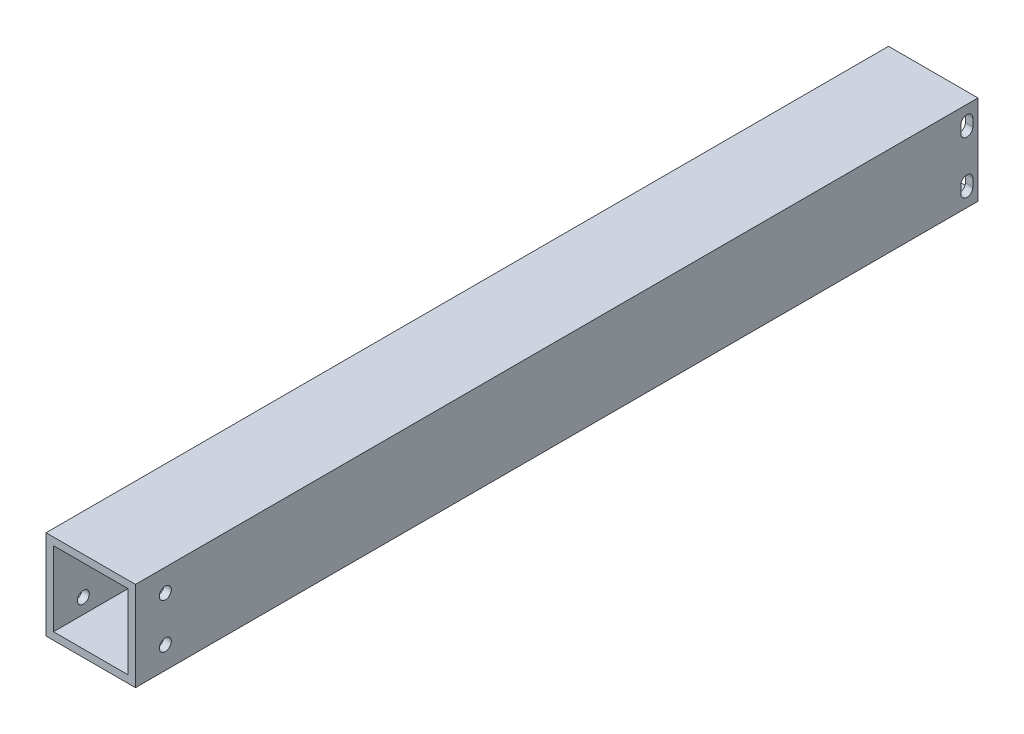
ISO-10303-21;
HEADER;
FILE_DESCRIPTION(('STEP AP214'),'2;1');
FILE_NAME('part.step','',(''),(''),'','','');
FILE_SCHEMA(('AUTOMOTIVE_DESIGN { 1 0 10303 214 1 1 1 1 }'));
ENDSEC;
DATA;
#1=APPLICATION_CONTEXT('core data for automotive mechanical design processes');
#2=APPLICATION_PROTOCOL_DEFINITION('international standard','automotive_design',2000,#1);
#3=PRODUCT_CONTEXT('',#1,'mechanical');
#4=PRODUCT('Part','Part','',(#3));
#5=PRODUCT_RELATED_PRODUCT_CATEGORY('part','',(#4));
#6=PRODUCT_DEFINITION_FORMATION('','',#4);
#7=PRODUCT_DEFINITION_CONTEXT('part definition',#1,'design');
#8=PRODUCT_DEFINITION('design','',#6,#7);
#9=PRODUCT_DEFINITION_SHAPE('','',#8);
#10=(LENGTH_UNIT() NAMED_UNIT(*) SI_UNIT(.MILLI.,.METRE.));
#11=(NAMED_UNIT(*) PLANE_ANGLE_UNIT() SI_UNIT($,.RADIAN.));
#12=(NAMED_UNIT(*) SI_UNIT($,.STERADIAN.) SOLID_ANGLE_UNIT());
#13=UNCERTAINTY_MEASURE_WITH_UNIT(LENGTH_MEASURE(1.E-05),#10,'distance_accuracy_value','');
#14=(GEOMETRIC_REPRESENTATION_CONTEXT(3) GLOBAL_UNCERTAINTY_ASSIGNED_CONTEXT((#13)) GLOBAL_UNIT_ASSIGNED_CONTEXT((#10,
#11,#12)) REPRESENTATION_CONTEXT('',''));
#15=CARTESIAN_POINT('',(0.,0.,0.));
#16=DIRECTION('',(0.,0.,1.));
#17=DIRECTION('',(1.,0.,0.));
#18=AXIS2_PLACEMENT_3D('',#15,#16,#17);
#19=CARTESIAN_POINT('',(0.,31.75,4.7625));
#20=DIRECTION('',(1.,0.,0.));
#21=DIRECTION('',(0.,0.,-1.));
#22=AXIS2_PLACEMENT_3D('',#19,#20,#21);
#23=CYLINDRICAL_SURFACE('',#22,2.5527);
#24=CARTESIAN_POINT('',(0.,31.75,4.7625));
#25=DIRECTION('',(1.,0.,0.));
#26=DIRECTION('',(0.,0.,-1.));
#27=AXIS2_PLACEMENT_3D('',#24,#25,#26);
#28=CIRCLE('',#27,2.5527);
#29=CARTESIAN_POINT('',(0.,31.75,2.2098));
#30=VERTEX_POINT('',#29);
#31=CARTESIAN_POINT('',(0.,31.75,7.31520000000002));
#32=VERTEX_POINT('',#31);
#33=EDGE_CURVE('E273',#30,#32,#28,.T.);
#34=ORIENTED_EDGE('',*,*,#33,.F.);
#35=DIRECTION('',(1.,0.,0.));
#36=VECTOR('',#35,1.);
#37=CARTESIAN_POINT('',(0.,31.75,2.2098));
#38=LINE('',#37,#36);
#39=CARTESIAN_POINT('',(3.1749999999017,31.75,2.2098));
#40=VERTEX_POINT('',#39);
#41=EDGE_CURVE('E187',#30,#40,#38,.T.);
#42=ORIENTED_EDGE('',*,*,#41,.T.);
#43=CARTESIAN_POINT('',(3.1749999999017,31.75,4.7625));
#44=DIRECTION('',(1.,0.,0.));
#45=DIRECTION('',(0.,0.,-1.));
#46=AXIS2_PLACEMENT_3D('',#43,#44,#45);
#47=CIRCLE('',#46,2.5527);
#48=CARTESIAN_POINT('',(3.1749999999017,31.75,7.31520000000001));
#49=VERTEX_POINT('',#48);
#50=EDGE_CURVE('E195',#40,#49,#47,.T.);
#51=ORIENTED_EDGE('',*,*,#50,.T.);
#52=DIRECTION('',(1.,0.,0.));
#53=VECTOR('',#52,1.);
#54=CARTESIAN_POINT('',(0.,31.75,7.31520000000001));
#55=LINE('',#54,#53);
#56=EDGE_CURVE('E216',#49,#32,#55,.F.);
#57=ORIENTED_EDGE('',*,*,#56,.T.);
#58=EDGE_LOOP('',(#34,#42,#51,#57));
#59=FACE_BOUND('',#58,.T.);
#60=ADVANCED_FACE('F16',(#59),#23,.F.);
#61=CARTESIAN_POINT('',(0.,31.75,7.31520000000001));
#62=DIRECTION('',(0.,0.,1.));
#63=DIRECTION('',(0.,-1.,0.));
#64=AXIS2_PLACEMENT_3D('',#61,#62,#63);
#65=PLANE('',#64);
#66=DIRECTION('',(0.,1.,0.));
#67=VECTOR('',#66,1.);
#68=CARTESIAN_POINT('',(0.,38.1,7.31520000000002));
#69=LINE('',#68,#67);
#70=CARTESIAN_POINT('',(0.,28.575,7.31520000000001));
#71=VERTEX_POINT('',#70);
#72=EDGE_CURVE('E272',#32,#71,#69,.F.);
#73=ORIENTED_EDGE('',*,*,#72,.F.);
#74=ORIENTED_EDGE('',*,*,#56,.F.);
#75=DIRECTION('',(0.,-1.,0.));
#76=VECTOR('',#75,1.);
#77=CARTESIAN_POINT('',(3.1749999999017,34.925,7.31520000000001));
#78=LINE('',#77,#76);
#79=CARTESIAN_POINT('',(3.1749999999017,28.575,7.3152));
#80=VERTEX_POINT('',#79);
#81=EDGE_CURVE('E306',#49,#80,#78,.T.);
#82=ORIENTED_EDGE('',*,*,#81,.T.);
#83=DIRECTION('',(1.,0.,0.));
#84=VECTOR('',#83,1.);
#85=CARTESIAN_POINT('',(0.,28.575,7.3152));
#86=LINE('',#85,#84);
#87=EDGE_CURVE('E174',#80,#71,#86,.F.);
#88=ORIENTED_EDGE('',*,*,#87,.T.);
#89=EDGE_LOOP('',(#73,#74,#82,#88));
#90=FACE_BOUND('',#89,.T.);
#91=ADVANCED_FACE('F692',(#90),#65,.F.);
#92=CARTESIAN_POINT('',(0.,28.575,4.7625));
#93=DIRECTION('',(1.,0.,0.));
#94=DIRECTION('',(0.,0.,-1.));
#95=AXIS2_PLACEMENT_3D('',#92,#93,#94);
#96=CYLINDRICAL_SURFACE('',#95,2.5527);
#97=CARTESIAN_POINT('',(0.,28.575,4.7625));
#98=DIRECTION('',(1.,0.,0.));
#99=DIRECTION('',(0.,0.,-1.));
#100=AXIS2_PLACEMENT_3D('',#97,#98,#99);
#101=CIRCLE('',#100,2.5527);
#102=CARTESIAN_POINT('',(0.,28.575,2.20979999999999));
#103=VERTEX_POINT('',#102);
#104=EDGE_CURVE('E270',#71,#103,#101,.T.);
#105=ORIENTED_EDGE('',*,*,#104,.F.);
#106=ORIENTED_EDGE('',*,*,#87,.F.);
#107=CARTESIAN_POINT('',(3.1749999999017,28.575,4.7625));
#108=DIRECTION('',(1.,0.,0.));
#109=DIRECTION('',(0.,0.,-1.));
#110=AXIS2_PLACEMENT_3D('',#107,#108,#109);
#111=CIRCLE('',#110,2.5527);
#112=CARTESIAN_POINT('',(3.1749999999017,28.575,2.2098));
#113=VERTEX_POINT('',#112);
#114=EDGE_CURVE('E19',#80,#113,#111,.T.);
#115=ORIENTED_EDGE('',*,*,#114,.T.);
#116=DIRECTION('',(1.,0.,0.));
#117=VECTOR('',#116,1.);
#118=CARTESIAN_POINT('',(0.,28.575,2.2098));
#119=LINE('',#118,#117);
#120=EDGE_CURVE('E181',#113,#103,#119,.F.);
#121=ORIENTED_EDGE('',*,*,#120,.T.);
#122=EDGE_LOOP('',(#105,#106,#115,#121));
#123=FACE_BOUND('',#122,.T.);
#124=ADVANCED_FACE('F197',(#123),#96,.F.);
#125=CARTESIAN_POINT('',(0.,31.75,2.2098));
#126=DIRECTION('',(0.,0.,-1.));
#127=DIRECTION('',(0.,1.,0.));
#128=AXIS2_PLACEMENT_3D('',#125,#126,#127);
#129=PLANE('',#128);
#130=DIRECTION('',(0.,1.,0.));
#131=VECTOR('',#130,1.);
#132=CARTESIAN_POINT('',(0.,38.1,2.20979999999998));
#133=LINE('',#132,#131);
#134=EDGE_CURVE('E186',#103,#30,#133,.T.);
#135=ORIENTED_EDGE('',*,*,#134,.F.);
#136=ORIENTED_EDGE('',*,*,#120,.F.);
#137=DIRECTION('',(0.,-1.,0.));
#138=VECTOR('',#137,1.);
#139=CARTESIAN_POINT('',(3.1749999999017,34.925,2.2098));
#140=LINE('',#139,#138);
#141=EDGE_CURVE('E184',#113,#40,#140,.F.);
#142=ORIENTED_EDGE('',*,*,#141,.T.);
#143=ORIENTED_EDGE('',*,*,#41,.F.);
#144=EDGE_LOOP('',(#135,#136,#142,#143));
#145=FACE_BOUND('',#144,.T.);
#146=ADVANCED_FACE('F183',(#145),#129,.F.);
#147=CARTESIAN_POINT('',(0.,9.525,346.075));
#148=DIRECTION('',(1.,0.,0.));
#149=DIRECTION('',(0.,0.,-1.));
#150=AXIS2_PLACEMENT_3D('',#147,#148,#149);
#151=CYLINDRICAL_SURFACE('',#150,2.55270000000002);
#152=CARTESIAN_POINT('',(3.1749999999017,9.525,346.075));
#153=DIRECTION('',(1.,0.,0.));
#154=DIRECTION('',(0.,0.,-1.));
#155=AXIS2_PLACEMENT_3D('',#152,#153,#154);
#156=CIRCLE('',#155,2.55270000000002);
#157=CARTESIAN_POINT('',(3.1749999999017,9.525,343.5223));
#158=VERTEX_POINT('',#157);
#159=EDGE_CURVE('E304',#158,#158,#156,.T.);
#160=ORIENTED_EDGE('',*,*,#159,.T.);
#161=EDGE_LOOP('',(#160));
#162=FACE_BOUND('',#161,.T.);
#163=CARTESIAN_POINT('',(0.,9.525,346.075));
#164=DIRECTION('',(1.,0.,0.));
#165=DIRECTION('',(0.,0.,-1.));
#166=AXIS2_PLACEMENT_3D('',#163,#164,#165);
#167=CIRCLE('',#166,2.55270000000002);
#168=CARTESIAN_POINT('',(0.,9.525,343.5223));
#169=VERTEX_POINT('',#168);
#170=EDGE_CURVE('E267',#169,#169,#167,.T.);
#171=ORIENTED_EDGE('',*,*,#170,.F.);
#172=EDGE_LOOP('',(#171));
#173=FACE_BOUND('',#172,.T.);
#174=ADVANCED_FACE('F668',(#162,#173),#151,.F.);
#175=CARTESIAN_POINT('',(0.,28.575,346.075));
#176=DIRECTION('',(1.,0.,0.));
#177=DIRECTION('',(0.,0.,-1.));
#178=AXIS2_PLACEMENT_3D('',#175,#176,#177);
#179=CYLINDRICAL_SURFACE('',#178,2.55270000000002);
#180=CARTESIAN_POINT('',(3.1749999999017,28.575,346.075));
#181=DIRECTION('',(1.,0.,0.));
#182=DIRECTION('',(0.,0.,-1.));
#183=AXIS2_PLACEMENT_3D('',#180,#181,#182);
#184=CIRCLE('',#183,2.55270000000002);
#185=CARTESIAN_POINT('',(3.1749999999017,28.575,343.5223));
#186=VERTEX_POINT('',#185);
#187=EDGE_CURVE('E301',#186,#186,#184,.T.);
#188=ORIENTED_EDGE('',*,*,#187,.T.);
#189=EDGE_LOOP('',(#188));
#190=FACE_BOUND('',#189,.T.);
#191=CARTESIAN_POINT('',(0.,28.575,346.075));
#192=DIRECTION('',(1.,0.,0.));
#193=DIRECTION('',(0.,0.,-1.));
#194=AXIS2_PLACEMENT_3D('',#191,#192,#193);
#195=CIRCLE('',#194,2.55270000000002);
#196=CARTESIAN_POINT('',(0.,28.575,343.5223));
#197=VERTEX_POINT('',#196);
#198=EDGE_CURVE('E264',#197,#197,#195,.T.);
#199=ORIENTED_EDGE('',*,*,#198,.F.);
#200=EDGE_LOOP('',(#199));
#201=FACE_BOUND('',#200,.T.);
#202=ADVANCED_FACE('F660',(#190,#201),#179,.F.);
#203=CARTESIAN_POINT('',(0.,6.34999999999999,4.7625));
#204=DIRECTION('',(1.,0.,0.));
#205=DIRECTION('',(0.,0.,-1.));
#206=AXIS2_PLACEMENT_3D('',#203,#204,#205);
#207=CYLINDRICAL_SURFACE('',#206,2.5527);
#208=CARTESIAN_POINT('',(0.,6.34999999999999,4.7625));
#209=DIRECTION('',(1.,0.,0.));
#210=DIRECTION('',(0.,0.,-1.));
#211=AXIS2_PLACEMENT_3D('',#208,#209,#210);
#212=CIRCLE('',#211,2.5527);
#213=CARTESIAN_POINT('',(0.,6.34999999999999,7.31520000000002));
#214=VERTEX_POINT('',#213);
#215=CARTESIAN_POINT('',(0.,6.34999999999999,2.2098));
#216=VERTEX_POINT('',#215);
#217=EDGE_CURVE('E262',#214,#216,#212,.T.);
#218=ORIENTED_EDGE('',*,*,#217,.F.);
#219=DIRECTION('',(1.,0.,0.));
#220=VECTOR('',#219,1.);
#221=CARTESIAN_POINT('',(0.,6.34999999999999,7.31520000000001));
#222=LINE('',#221,#220);
#223=CARTESIAN_POINT('',(3.1749999999017,6.34999999999999,7.31520000000001));
#224=VERTEX_POINT('',#223);
#225=EDGE_CURVE('E198',#214,#224,#222,.T.);
#226=ORIENTED_EDGE('',*,*,#225,.T.);
#227=CARTESIAN_POINT('',(3.1749999999017,6.34999999999999,4.7625));
#228=DIRECTION('',(1.,0.,0.));
#229=DIRECTION('',(0.,0.,-1.));
#230=AXIS2_PLACEMENT_3D('',#227,#228,#229);
#231=CIRCLE('',#230,2.5527);
#232=CARTESIAN_POINT('',(3.1749999999017,6.34999999999999,2.2098));
#233=VERTEX_POINT('',#232);
#234=EDGE_CURVE('E294',#224,#233,#231,.T.);
#235=ORIENTED_EDGE('',*,*,#234,.T.);
#236=DIRECTION('',(1.,0.,0.));
#237=VECTOR('',#236,1.);
#238=CARTESIAN_POINT('',(0.,6.34999999999999,2.2098));
#239=LINE('',#238,#237);
#240=EDGE_CURVE('E211',#233,#216,#239,.F.);
#241=ORIENTED_EDGE('',*,*,#240,.T.);
#242=EDGE_LOOP('',(#218,#226,#235,#241));
#243=FACE_BOUND('',#242,.T.);
#244=ADVANCED_FACE('F651',(#243),#207,.F.);
#245=CARTESIAN_POINT('',(0.,6.34999999999999,2.2098));
#246=DIRECTION('',(0.,0.,-1.));
#247=DIRECTION('',(0.,1.,0.));
#248=AXIS2_PLACEMENT_3D('',#245,#246,#247);
#249=PLANE('',#248);
#250=DIRECTION('',(0.,1.,0.));
#251=VECTOR('',#250,1.);
#252=CARTESIAN_POINT('',(0.,38.1,2.20979999999998));
#253=LINE('',#252,#251);
#254=CARTESIAN_POINT('',(0.,9.525,2.20979999999999));
#255=VERTEX_POINT('',#254);
#256=EDGE_CURVE('E261',#216,#255,#253,.T.);
#257=ORIENTED_EDGE('',*,*,#256,.F.);
#258=ORIENTED_EDGE('',*,*,#240,.F.);
#259=DIRECTION('',(0.,-1.,0.));
#260=VECTOR('',#259,1.);
#261=CARTESIAN_POINT('',(3.1749999999017,34.925,2.2098));
#262=LINE('',#261,#260);
#263=CARTESIAN_POINT('',(3.1749999999017,9.525,2.2098));
#264=VERTEX_POINT('',#263);
#265=EDGE_CURVE('E296',#233,#264,#262,.F.);
#266=ORIENTED_EDGE('',*,*,#265,.T.);
#267=DIRECTION('',(1.,0.,0.));
#268=VECTOR('',#267,1.);
#269=CARTESIAN_POINT('',(0.,9.525,2.2098));
#270=LINE('',#269,#268);
#271=EDGE_CURVE('E206',#264,#255,#270,.F.);
#272=ORIENTED_EDGE('',*,*,#271,.T.);
#273=EDGE_LOOP('',(#257,#258,#266,#272));
#274=FACE_BOUND('',#273,.T.);
#275=ADVANCED_FACE('F642',(#274),#249,.F.);
#276=CARTESIAN_POINT('',(0.,9.525,4.7625));
#277=DIRECTION('',(1.,0.,0.));
#278=DIRECTION('',(0.,0.,-1.));
#279=AXIS2_PLACEMENT_3D('',#276,#277,#278);
#280=CYLINDRICAL_SURFACE('',#279,2.5527);
#281=CARTESIAN_POINT('',(0.,9.525,4.7625));
#282=DIRECTION('',(1.,0.,0.));
#283=DIRECTION('',(0.,0.,-1.));
#284=AXIS2_PLACEMENT_3D('',#281,#282,#283);
#285=CIRCLE('',#284,2.5527);
#286=CARTESIAN_POINT('',(0.,9.525,7.31520000000002));
#287=VERTEX_POINT('',#286);
#288=EDGE_CURVE('E258',#255,#287,#285,.T.);
#289=ORIENTED_EDGE('',*,*,#288,.F.);
#290=ORIENTED_EDGE('',*,*,#271,.F.);
#291=CARTESIAN_POINT('',(3.1749999999017,9.525,4.7625));
#292=DIRECTION('',(1.,0.,0.));
#293=DIRECTION('',(0.,0.,-1.));
#294=AXIS2_PLACEMENT_3D('',#291,#292,#293);
#295=CIRCLE('',#294,2.5527);
#296=CARTESIAN_POINT('',(3.1749999999017,9.525,7.31520000000001));
#297=VERTEX_POINT('',#296);
#298=EDGE_CURVE('E298',#264,#297,#295,.T.);
#299=ORIENTED_EDGE('',*,*,#298,.T.);
#300=DIRECTION('',(1.,0.,0.));
#301=VECTOR('',#300,1.);
#302=CARTESIAN_POINT('',(0.,9.525,7.31520000000001));
#303=LINE('',#302,#301);
#304=EDGE_CURVE('E199',#297,#287,#303,.F.);
#305=ORIENTED_EDGE('',*,*,#304,.T.);
#306=EDGE_LOOP('',(#289,#290,#299,#305));
#307=FACE_BOUND('',#306,.T.);
#308=ADVANCED_FACE('F633',(#307),#280,.F.);
#309=CARTESIAN_POINT('',(0.,6.34999999999999,7.31520000000001));
#310=DIRECTION('',(0.,0.,1.));
#311=DIRECTION('',(0.,-1.,0.));
#312=AXIS2_PLACEMENT_3D('',#309,#310,#311);
#313=PLANE('',#312);
#314=DIRECTION('',(0.,1.,0.));
#315=VECTOR('',#314,1.);
#316=CARTESIAN_POINT('',(0.,38.1,7.31520000000002));
#317=LINE('',#316,#315);
#318=EDGE_CURVE('E260',#287,#214,#317,.F.);
#319=ORIENTED_EDGE('',*,*,#318,.F.);
#320=ORIENTED_EDGE('',*,*,#304,.F.);
#321=DIRECTION('',(0.,-1.,0.));
#322=VECTOR('',#321,1.);
#323=CARTESIAN_POINT('',(3.1749999999017,34.925,7.31520000000001));
#324=LINE('',#323,#322);
#325=EDGE_CURVE('E297',#297,#224,#324,.T.);
#326=ORIENTED_EDGE('',*,*,#325,.T.);
#327=ORIENTED_EDGE('',*,*,#225,.F.);
#328=EDGE_LOOP('',(#319,#320,#326,#327));
#329=FACE_BOUND('',#328,.T.);
#330=ADVANCED_FACE('F624',(#329),#313,.F.);
#331=CARTESIAN_POINT('',(3.1749999999017,34.925,0.));
#332=DIRECTION('',(-1.,0.,0.));
#333=DIRECTION('',(0.,-1.,0.));
#334=AXIS2_PLACEMENT_3D('',#331,#332,#333);
#335=PLANE('',#334);
#336=DIRECTION('',(0.,0.,-1.));
#337=VECTOR('',#336,1.);
#338=CARTESIAN_POINT('',(3.1749999999017,3.17499999992628,0.));
#339=LINE('',#338,#337);
#340=CARTESIAN_POINT('',(3.1749999999017,3.17499999992628,358.775));
#341=VERTEX_POINT('',#340);
#342=CARTESIAN_POINT('',(3.1749999999017,3.17499999992628,0.));
#343=VERTEX_POINT('',#342);
#344=EDGE_CURVE('E315',#341,#343,#339,.T.);
#345=ORIENTED_EDGE('',*,*,#344,.T.);
#346=DIRECTION('',(0.,1.,0.));
#347=VECTOR('',#346,1.);
#348=CARTESIAN_POINT('',(3.1749999999017,38.1,0.));
#349=LINE('',#348,#347);
#350=CARTESIAN_POINT('',(3.1749999999017,34.925,0.));
#351=VERTEX_POINT('',#350);
#352=EDGE_CURVE('E364',#351,#343,#349,.F.);
#353=ORIENTED_EDGE('',*,*,#352,.F.);
#354=DIRECTION('',(0.,0.,1.));
#355=VECTOR('',#354,1.);
#356=CARTESIAN_POINT('',(3.1749999999017,34.925,0.));
#357=LINE('',#356,#355);
#358=CARTESIAN_POINT('',(3.1749999999017,34.925,358.775));
#359=VERTEX_POINT('',#358);
#360=EDGE_CURVE('E293',#351,#359,#357,.T.);
#361=ORIENTED_EDGE('',*,*,#360,.T.);
#362=DIRECTION('',(0.,1.,0.));
#363=VECTOR('',#362,1.);
#364=CARTESIAN_POINT('',(3.1749999999017,38.1,358.775));
#365=LINE('',#364,#363);
#366=EDGE_CURVE('E341',#341,#359,#365,.T.);
#367=ORIENTED_EDGE('',*,*,#366,.F.);
#368=EDGE_LOOP('',(#345,#353,#361,#367));
#369=FACE_BOUND('',#368,.T.);
#370=ORIENTED_EDGE('',*,*,#234,.F.);
#371=ORIENTED_EDGE('',*,*,#325,.F.);
#372=ORIENTED_EDGE('',*,*,#298,.F.);
#373=ORIENTED_EDGE('',*,*,#265,.F.);
#374=EDGE_LOOP('',(#370,#371,#372,#373));
#375=FACE_BOUND('',#374,.T.);
#376=ORIENTED_EDGE('',*,*,#187,.F.);
#377=EDGE_LOOP('',(#376));
#378=FACE_BOUND('',#377,.T.);
#379=ORIENTED_EDGE('',*,*,#159,.F.);
#380=EDGE_LOOP('',(#379));
#381=FACE_BOUND('',#380,.T.);
#382=ORIENTED_EDGE('',*,*,#50,.F.);
#383=ORIENTED_EDGE('',*,*,#141,.F.);
#384=ORIENTED_EDGE('',*,*,#114,.F.);
#385=ORIENTED_EDGE('',*,*,#81,.F.);
#386=EDGE_LOOP('',(#382,#383,#384,#385));
#387=FACE_BOUND('',#386,.T.);
#388=ADVANCED_FACE('F191',(#369,#375,#378,#381,#387),#335,.F.);
#389=CARTESIAN_POINT('',(3.1749999999017,3.17499999992628,0.));
#390=DIRECTION('',(0.,-1.,0.));
#391=DIRECTION('',(0.,0.,-1.));
#392=AXIS2_PLACEMENT_3D('',#389,#390,#391);
#393=PLANE('',#392);
#394=DIRECTION('',(0.,0.,1.));
#395=VECTOR('',#394,1.);
#396=CARTESIAN_POINT('',(34.925,3.17499999992628,0.));
#397=LINE('',#396,#395);
#398=CARTESIAN_POINT('',(34.925,3.17499999992628,358.775));
#399=VERTEX_POINT('',#398);
#400=CARTESIAN_POINT('',(34.925,3.17499999992628,0.));
#401=VERTEX_POINT('',#400);
#402=EDGE_CURVE('E318',#399,#401,#397,.F.);
#403=ORIENTED_EDGE('',*,*,#402,.T.);
#404=DIRECTION('',(-1.,0.,0.));
#405=VECTOR('',#404,1.);
#406=CARTESIAN_POINT('',(0.,3.17499999992628,0.));
#407=LINE('',#406,#405);
#408=EDGE_CURVE('E366',#343,#401,#407,.F.);
#409=ORIENTED_EDGE('',*,*,#408,.F.);
#410=ORIENTED_EDGE('',*,*,#344,.F.);
#411=DIRECTION('',(1.,0.,0.));
#412=VECTOR('',#411,1.);
#413=CARTESIAN_POINT('',(38.1,3.17499999992628,358.775));
#414=LINE('',#413,#412);
#415=EDGE_CURVE('E351',#399,#341,#414,.F.);
#416=ORIENTED_EDGE('',*,*,#415,.F.);
#417=EDGE_LOOP('',(#403,#409,#410,#416));
#418=FACE_BOUND('',#417,.T.);
#419=ADVANCED_FACE('F443',(#418),#393,.F.);
#420=CARTESIAN_POINT('',(34.925,3.17499999992628,0.));
#421=DIRECTION('',(1.,0.,0.));
#422=DIRECTION('',(0.,1.,0.));
#423=AXIS2_PLACEMENT_3D('',#420,#421,#422);
#424=PLANE('',#423);
#425=DIRECTION('',(0.,0.,1.));
#426=VECTOR('',#425,1.);
#427=CARTESIAN_POINT('',(34.925,34.925,0.));
#428=LINE('',#427,#426);
#429=CARTESIAN_POINT('',(34.925,34.925,358.775));
#430=VERTEX_POINT('',#429);
#431=CARTESIAN_POINT('',(34.925,34.925,0.));
#432=VERTEX_POINT('',#431);
#433=EDGE_CURVE('E321',#430,#432,#428,.F.);
#434=ORIENTED_EDGE('',*,*,#433,.T.);
#435=DIRECTION('',(0.,1.,0.));
#436=VECTOR('',#435,1.);
#437=CARTESIAN_POINT('',(34.925,38.1,0.));
#438=LINE('',#437,#436);
#439=EDGE_CURVE('E368',#401,#432,#438,.T.);
#440=ORIENTED_EDGE('',*,*,#439,.F.);
#441=ORIENTED_EDGE('',*,*,#402,.F.);
#442=DIRECTION('',(0.,1.,0.));
#443=VECTOR('',#442,1.);
#444=CARTESIAN_POINT('',(34.925,38.1,358.775));
#445=LINE('',#444,#443);
#446=EDGE_CURVE('E348',#430,#399,#445,.F.);
#447=ORIENTED_EDGE('',*,*,#446,.F.);
#448=EDGE_LOOP('',(#434,#440,#441,#447));
#449=FACE_BOUND('',#448,.T.);
#450=CARTESIAN_POINT('',(34.925,6.34999999999999,4.7625));
#451=DIRECTION('',(1.,0.,0.));
#452=DIRECTION('',(0.,0.,-1.));
#453=AXIS2_PLACEMENT_3D('',#450,#451,#452);
#454=CIRCLE('',#453,2.5527);
#455=CARTESIAN_POINT('',(34.925,6.34999999999999,7.31520000000001));
#456=VERTEX_POINT('',#455);
#457=CARTESIAN_POINT('',(34.925,6.34999999999999,2.2098));
#458=VERTEX_POINT('',#457);
#459=EDGE_CURVE('E228',#456,#458,#454,.T.);
#460=ORIENTED_EDGE('',*,*,#459,.T.);
#461=DIRECTION('',(0.,1.,0.));
#462=VECTOR('',#461,1.);
#463=CARTESIAN_POINT('',(34.925,6.34999999999999,2.2098));
#464=LINE('',#463,#462);
#465=CARTESIAN_POINT('',(34.925,9.525,2.2098));
#466=VERTEX_POINT('',#465);
#467=EDGE_CURVE('E219',#458,#466,#464,.T.);
#468=ORIENTED_EDGE('',*,*,#467,.T.);
#469=CARTESIAN_POINT('',(34.925,9.525,4.7625));
#470=DIRECTION('',(1.,0.,0.));
#471=DIRECTION('',(0.,0.,-1.));
#472=AXIS2_PLACEMENT_3D('',#469,#470,#471);
#473=CIRCLE('',#472,2.5527);
#474=CARTESIAN_POINT('',(34.925,9.525,7.31520000000001));
#475=VERTEX_POINT('',#474);
#476=EDGE_CURVE('E276',#466,#475,#473,.T.);
#477=ORIENTED_EDGE('',*,*,#476,.T.);
#478=DIRECTION('',(0.,-1.,0.));
#479=VECTOR('',#478,1.);
#480=CARTESIAN_POINT('',(34.925,6.34999999999999,7.31520000000001));
#481=LINE('',#480,#479);
#482=EDGE_CURVE('E224',#475,#456,#481,.T.);
#483=ORIENTED_EDGE('',*,*,#482,.T.);
#484=EDGE_LOOP('',(#460,#468,#477,#483));
#485=FACE_BOUND('',#484,.T.);
#486=CARTESIAN_POINT('',(34.925,28.575,346.075));
#487=DIRECTION('',(1.,0.,0.));
#488=DIRECTION('',(0.,0.,-1.));
#489=AXIS2_PLACEMENT_3D('',#486,#487,#488);
#490=CIRCLE('',#489,2.55270000000002);
#491=CARTESIAN_POINT('',(34.925,28.575,343.5223));
#492=VERTEX_POINT('',#491);
#493=EDGE_CURVE('E281',#492,#492,#490,.T.);
#494=ORIENTED_EDGE('',*,*,#493,.T.);
#495=EDGE_LOOP('',(#494));
#496=FACE_BOUND('',#495,.T.);
#497=CARTESIAN_POINT('',(34.925,9.525,346.075));
#498=DIRECTION('',(1.,0.,0.));
#499=DIRECTION('',(0.,0.,-1.));
#500=AXIS2_PLACEMENT_3D('',#497,#498,#499);
#501=CIRCLE('',#500,2.55270000000002);
#502=CARTESIAN_POINT('',(34.925,9.525,343.5223));
#503=VERTEX_POINT('',#502);
#504=EDGE_CURVE('E284',#503,#503,#501,.T.);
#505=ORIENTED_EDGE('',*,*,#504,.T.);
#506=EDGE_LOOP('',(#505));
#507=FACE_BOUND('',#506,.T.);
#508=CARTESIAN_POINT('',(34.925,31.75,4.7625));
#509=DIRECTION('',(1.,0.,0.));
#510=DIRECTION('',(0.,0.,-1.));
#511=AXIS2_PLACEMENT_3D('',#508,#509,#510);
#512=CIRCLE('',#511,2.5527);
#513=CARTESIAN_POINT('',(34.925,31.75,2.2098));
#514=VERTEX_POINT('',#513);
#515=CARTESIAN_POINT('',(34.925,31.75,7.31520000000001));
#516=VERTEX_POINT('',#515);
#517=EDGE_CURVE('E238',#514,#516,#512,.T.);
#518=ORIENTED_EDGE('',*,*,#517,.T.);
#519=DIRECTION('',(0.,-1.,0.));
#520=VECTOR('',#519,1.);
#521=CARTESIAN_POINT('',(34.925,31.75,7.31520000000001));
#522=LINE('',#521,#520);
#523=CARTESIAN_POINT('',(34.925,28.575,7.31520000000001));
#524=VERTEX_POINT('',#523);
#525=EDGE_CURVE('E229',#516,#524,#522,.T.);
#526=ORIENTED_EDGE('',*,*,#525,.T.);
#527=CARTESIAN_POINT('',(34.925,28.575,4.7625));
#528=DIRECTION('',(1.,0.,0.));
#529=DIRECTION('',(0.,0.,-1.));
#530=AXIS2_PLACEMENT_3D('',#527,#528,#529);
#531=CIRCLE('',#530,2.5527);
#532=CARTESIAN_POINT('',(34.925,28.575,2.2098));
#533=VERTEX_POINT('',#532);
#534=EDGE_CURVE('E288',#524,#533,#531,.T.);
#535=ORIENTED_EDGE('',*,*,#534,.T.);
#536=DIRECTION('',(0.,1.,0.));
#537=VECTOR('',#536,1.);
#538=CARTESIAN_POINT('',(34.925,31.75,2.2098));
#539=LINE('',#538,#537);
#540=EDGE_CURVE('E234',#533,#514,#539,.T.);
#541=ORIENTED_EDGE('',*,*,#540,.T.);
#542=EDGE_LOOP('',(#518,#526,#535,#541));
#543=FACE_BOUND('',#542,.T.);
#544=ADVANCED_FACE('F440',(#449,#485,#496,#507,#543),#424,.F.);
#545=CARTESIAN_POINT('',(34.925,34.925,0.));
#546=DIRECTION('',(0.,1.,0.));
#547=DIRECTION('',(0.,0.,1.));
#548=AXIS2_PLACEMENT_3D('',#545,#546,#547);
#549=PLANE('',#548);
#550=ORIENTED_EDGE('',*,*,#360,.F.);
#551=DIRECTION('',(-1.,0.,0.));
#552=VECTOR('',#551,1.);
#553=CARTESIAN_POINT('',(0.,34.925,0.));
#554=LINE('',#553,#552);
#555=EDGE_CURVE('E370',#432,#351,#554,.T.);
#556=ORIENTED_EDGE('',*,*,#555,.F.);
#557=ORIENTED_EDGE('',*,*,#433,.F.);
#558=DIRECTION('',(1.,0.,0.));
#559=VECTOR('',#558,1.);
#560=CARTESIAN_POINT('',(38.1,34.925,358.775));
#561=LINE('',#560,#559);
#562=EDGE_CURVE('E345',#359,#430,#561,.T.);
#563=ORIENTED_EDGE('',*,*,#562,.F.);
#564=EDGE_LOOP('',(#550,#556,#557,#563));
#565=FACE_BOUND('',#564,.T.);
#566=ADVANCED_FACE('F442',(#565),#549,.F.);
#567=CARTESIAN_POINT('',(0.,31.75,4.7625));
#568=DIRECTION('',(1.,0.,0.));
#569=DIRECTION('',(0.,0.,-1.));
#570=AXIS2_PLACEMENT_3D('',#567,#568,#569);
#571=CYLINDRICAL_SURFACE('',#570,2.5527);
#572=CARTESIAN_POINT('',(38.1,31.75,4.7625));
#573=DIRECTION('',(1.,0.,0.));
#574=DIRECTION('',(0.,0.,-1.));
#575=AXIS2_PLACEMENT_3D('',#572,#573,#574);
#576=CIRCLE('',#575,2.5527);
#577=CARTESIAN_POINT('',(38.1,31.75,7.31520000000001));
#578=VERTEX_POINT('',#577);
#579=CARTESIAN_POINT('',(38.1,31.75,2.2098));
#580=VERTEX_POINT('',#579);
#581=EDGE_CURVE('E255',#578,#580,#576,.F.);
#582=ORIENTED_EDGE('',*,*,#581,.F.);
#583=DIRECTION('',(1.,0.,0.));
#584=VECTOR('',#583,1.);
#585=CARTESIAN_POINT('',(0.,31.75,7.31520000000001));
#586=LINE('',#585,#584);
#587=EDGE_CURVE('E287',#578,#516,#586,.F.);
#588=ORIENTED_EDGE('',*,*,#587,.T.);
#589=ORIENTED_EDGE('',*,*,#517,.F.);
#590=DIRECTION('',(1.,0.,0.));
#591=VECTOR('',#590,1.);
#592=CARTESIAN_POINT('',(0.,31.75,2.2098));
#593=LINE('',#592,#591);
#594=EDGE_CURVE('E237',#514,#580,#593,.T.);
#595=ORIENTED_EDGE('',*,*,#594,.T.);
#596=EDGE_LOOP('',(#582,#588,#589,#595));
#597=FACE_BOUND('',#596,.T.);
#598=ADVANCED_FACE('F435',(#597),#571,.F.);
#599=CARTESIAN_POINT('',(0.,31.75,2.2098));
#600=DIRECTION('',(0.,0.,-1.));
#601=DIRECTION('',(0.,1.,0.));
#602=AXIS2_PLACEMENT_3D('',#599,#600,#601);
#603=PLANE('',#602);
#604=DIRECTION('',(0.,1.,0.));
#605=VECTOR('',#604,1.);
#606=CARTESIAN_POINT('',(38.1,38.1,2.2098));
#607=LINE('',#606,#605);
#608=CARTESIAN_POINT('',(38.1,28.575,2.2098));
#609=VERTEX_POINT('',#608);
#610=EDGE_CURVE('E254',#580,#609,#607,.F.);
#611=ORIENTED_EDGE('',*,*,#610,.F.);
#612=ORIENTED_EDGE('',*,*,#594,.F.);
#613=ORIENTED_EDGE('',*,*,#540,.F.);
#614=DIRECTION('',(1.,0.,0.));
#615=VECTOR('',#614,1.);
#616=CARTESIAN_POINT('',(0.,28.575,2.2098));
#617=LINE('',#616,#615);
#618=EDGE_CURVE('E233',#533,#609,#617,.T.);
#619=ORIENTED_EDGE('',*,*,#618,.T.);
#620=EDGE_LOOP('',(#611,#612,#613,#619));
#621=FACE_BOUND('',#620,.T.);
#622=ADVANCED_FACE('F438',(#621),#603,.F.);
#623=CARTESIAN_POINT('',(0.,28.575,4.7625));
#624=DIRECTION('',(1.,0.,0.));
#625=DIRECTION('',(0.,0.,-1.));
#626=AXIS2_PLACEMENT_3D('',#623,#624,#625);
#627=CYLINDRICAL_SURFACE('',#626,2.5527);
#628=CARTESIAN_POINT('',(38.1,28.575,4.7625));
#629=DIRECTION('',(1.,0.,0.));
#630=DIRECTION('',(0.,0.,-1.));
#631=AXIS2_PLACEMENT_3D('',#628,#629,#630);
#632=CIRCLE('',#631,2.5527);
#633=CARTESIAN_POINT('',(38.1,28.575,7.31520000000001));
#634=VERTEX_POINT('',#633);
#635=EDGE_CURVE('E252',#609,#634,#632,.F.);
#636=ORIENTED_EDGE('',*,*,#635,.F.);
#637=ORIENTED_EDGE('',*,*,#618,.F.);
#638=ORIENTED_EDGE('',*,*,#534,.F.);
#639=DIRECTION('',(1.,0.,0.));
#640=VECTOR('',#639,1.);
#641=CARTESIAN_POINT('',(0.,28.575,7.31520000000001));
#642=LINE('',#641,#640);
#643=EDGE_CURVE('E232',#524,#634,#642,.T.);
#644=ORIENTED_EDGE('',*,*,#643,.T.);
#645=EDGE_LOOP('',(#636,#637,#638,#644));
#646=FACE_BOUND('',#645,.T.);
#647=ADVANCED_FACE('F431',(#646),#627,.F.);
#648=CARTESIAN_POINT('',(0.,31.75,7.31520000000001));
#649=DIRECTION('',(0.,0.,1.));
#650=DIRECTION('',(0.,-1.,0.));
#651=AXIS2_PLACEMENT_3D('',#648,#649,#650);
#652=PLANE('',#651);
#653=DIRECTION('',(0.,1.,0.));
#654=VECTOR('',#653,1.);
#655=CARTESIAN_POINT('',(38.1,38.1,7.31520000000001));
#656=LINE('',#655,#654);
#657=EDGE_CURVE('E251',#634,#578,#656,.T.);
#658=ORIENTED_EDGE('',*,*,#657,.F.);
#659=ORIENTED_EDGE('',*,*,#643,.F.);
#660=ORIENTED_EDGE('',*,*,#525,.F.);
#661=ORIENTED_EDGE('',*,*,#587,.F.);
#662=EDGE_LOOP('',(#658,#659,#660,#661));
#663=FACE_BOUND('',#662,.T.);
#664=ADVANCED_FACE('F433',(#663),#652,.F.);
#665=CARTESIAN_POINT('',(0.,9.525,346.075));
#666=DIRECTION('',(1.,0.,0.));
#667=DIRECTION('',(0.,0.,-1.));
#668=AXIS2_PLACEMENT_3D('',#665,#666,#667);
#669=CYLINDRICAL_SURFACE('',#668,2.55270000000002);
#670=CARTESIAN_POINT('',(38.1,9.525,346.075));
#671=DIRECTION('',(1.,0.,0.));
#672=DIRECTION('',(0.,0.,-1.));
#673=AXIS2_PLACEMENT_3D('',#670,#671,#672);
#674=CIRCLE('',#673,2.55270000000002);
#675=CARTESIAN_POINT('',(38.1,9.525,343.5223));
#676=VERTEX_POINT('',#675);
#677=EDGE_CURVE('E248',#676,#676,#674,.F.);
#678=ORIENTED_EDGE('',*,*,#677,.F.);
#679=EDGE_LOOP('',(#678));
#680=FACE_BOUND('',#679,.T.);
#681=ORIENTED_EDGE('',*,*,#504,.F.);
#682=EDGE_LOOP('',(#681));
#683=FACE_BOUND('',#682,.T.);
#684=ADVANCED_FACE('F490',(#680,#683),#669,.F.);
#685=CARTESIAN_POINT('',(0.,28.575,346.075));
#686=DIRECTION('',(1.,0.,0.));
#687=DIRECTION('',(0.,0.,-1.));
#688=AXIS2_PLACEMENT_3D('',#685,#686,#687);
#689=CYLINDRICAL_SURFACE('',#688,2.55270000000002);
#690=CARTESIAN_POINT('',(38.1,28.575,346.075));
#691=DIRECTION('',(1.,0.,0.));
#692=DIRECTION('',(0.,0.,-1.));
#693=AXIS2_PLACEMENT_3D('',#690,#691,#692);
#694=CIRCLE('',#693,2.55270000000002);
#695=CARTESIAN_POINT('',(38.1,28.575,343.5223));
#696=VERTEX_POINT('',#695);
#697=EDGE_CURVE('E245',#696,#696,#694,.F.);
#698=ORIENTED_EDGE('',*,*,#697,.F.);
#699=EDGE_LOOP('',(#698));
#700=FACE_BOUND('',#699,.T.);
#701=ORIENTED_EDGE('',*,*,#493,.F.);
#702=EDGE_LOOP('',(#701));
#703=FACE_BOUND('',#702,.T.);
#704=ADVANCED_FACE('F486',(#700,#703),#689,.F.);
#705=CARTESIAN_POINT('',(0.,6.34999999999999,4.7625));
#706=DIRECTION('',(1.,0.,0.));
#707=DIRECTION('',(0.,0.,-1.));
#708=AXIS2_PLACEMENT_3D('',#705,#706,#707);
#709=CYLINDRICAL_SURFACE('',#708,2.5527);
#710=CARTESIAN_POINT('',(38.1,6.34999999999999,4.7625));
#711=DIRECTION('',(1.,0.,0.));
#712=DIRECTION('',(0.,0.,-1.));
#713=AXIS2_PLACEMENT_3D('',#710,#711,#712);
#714=CIRCLE('',#713,2.5527);
#715=CARTESIAN_POINT('',(38.1,6.34999999999999,2.2098));
#716=VERTEX_POINT('',#715);
#717=CARTESIAN_POINT('',(38.1,6.34999999999999,7.31520000000001));
#718=VERTEX_POINT('',#717);
#719=EDGE_CURVE('E243',#716,#718,#714,.F.);
#720=ORIENTED_EDGE('',*,*,#719,.F.);
#721=DIRECTION('',(1.,0.,0.));
#722=VECTOR('',#721,1.);
#723=CARTESIAN_POINT('',(0.,6.34999999999999,2.2098));
#724=LINE('',#723,#722);
#725=EDGE_CURVE('E338',#716,#458,#724,.F.);
#726=ORIENTED_EDGE('',*,*,#725,.T.);
#727=ORIENTED_EDGE('',*,*,#459,.F.);
#728=DIRECTION('',(1.,0.,0.));
#729=VECTOR('',#728,1.);
#730=CARTESIAN_POINT('',(0.,6.34999999999999,7.31520000000001));
#731=LINE('',#730,#729);
#732=EDGE_CURVE('E227',#456,#718,#731,.T.);
#733=ORIENTED_EDGE('',*,*,#732,.T.);
#734=EDGE_LOOP('',(#720,#726,#727,#733));
#735=FACE_BOUND('',#734,.T.);
#736=ADVANCED_FACE('F482',(#735),#709,.F.);
#737=CARTESIAN_POINT('',(0.,6.34999999999999,7.31520000000001));
#738=DIRECTION('',(0.,0.,1.));
#739=DIRECTION('',(0.,-1.,0.));
#740=AXIS2_PLACEMENT_3D('',#737,#738,#739);
#741=PLANE('',#740);
#742=DIRECTION('',(0.,1.,0.));
#743=VECTOR('',#742,1.);
#744=CARTESIAN_POINT('',(38.1,38.1,7.31520000000001));
#745=LINE('',#744,#743);
#746=CARTESIAN_POINT('',(38.1,9.525,7.3152));
#747=VERTEX_POINT('',#746);
#748=EDGE_CURVE('E242',#718,#747,#745,.T.);
#749=ORIENTED_EDGE('',*,*,#748,.F.);
#750=ORIENTED_EDGE('',*,*,#732,.F.);
#751=ORIENTED_EDGE('',*,*,#482,.F.);
#752=DIRECTION('',(1.,0.,0.));
#753=VECTOR('',#752,1.);
#754=CARTESIAN_POINT('',(0.,9.525,7.3152));
#755=LINE('',#754,#753);
#756=EDGE_CURVE('E223',#475,#747,#755,.T.);
#757=ORIENTED_EDGE('',*,*,#756,.T.);
#758=EDGE_LOOP('',(#749,#750,#751,#757));
#759=FACE_BOUND('',#758,.T.);
#760=ADVANCED_FACE('F478',(#759),#741,.F.);
#761=CARTESIAN_POINT('',(0.,9.525,4.7625));
#762=DIRECTION('',(1.,0.,0.));
#763=DIRECTION('',(0.,0.,-1.));
#764=AXIS2_PLACEMENT_3D('',#761,#762,#763);
#765=CYLINDRICAL_SURFACE('',#764,2.5527);
#766=CARTESIAN_POINT('',(38.1,9.525,4.7625));
#767=DIRECTION('',(1.,0.,0.));
#768=DIRECTION('',(0.,0.,-1.));
#769=AXIS2_PLACEMENT_3D('',#766,#767,#768);
#770=CIRCLE('',#769,2.5527);
#771=CARTESIAN_POINT('',(38.1,9.525,2.2098));
#772=VERTEX_POINT('',#771);
#773=EDGE_CURVE('E239',#747,#772,#770,.F.);
#774=ORIENTED_EDGE('',*,*,#773,.F.);
#775=ORIENTED_EDGE('',*,*,#756,.F.);
#776=ORIENTED_EDGE('',*,*,#476,.F.);
#777=DIRECTION('',(1.,0.,0.));
#778=VECTOR('',#777,1.);
#779=CARTESIAN_POINT('',(0.,9.525,2.2098));
#780=LINE('',#779,#778);
#781=EDGE_CURVE('E222',#466,#772,#780,.T.);
#782=ORIENTED_EDGE('',*,*,#781,.T.);
#783=EDGE_LOOP('',(#774,#775,#776,#782));
#784=FACE_BOUND('',#783,.T.);
#785=ADVANCED_FACE('F474',(#784),#765,.F.);
#786=CARTESIAN_POINT('',(0.,6.34999999999999,2.2098));
#787=DIRECTION('',(0.,0.,-1.));
#788=DIRECTION('',(0.,1.,0.));
#789=AXIS2_PLACEMENT_3D('',#786,#787,#788);
#790=PLANE('',#789);
#791=DIRECTION('',(0.,1.,0.));
#792=VECTOR('',#791,1.);
#793=CARTESIAN_POINT('',(38.1,38.1,2.2098));
#794=LINE('',#793,#792);
#795=EDGE_CURVE('E241',#772,#716,#794,.F.);
#796=ORIENTED_EDGE('',*,*,#795,.F.);
#797=ORIENTED_EDGE('',*,*,#781,.F.);
#798=ORIENTED_EDGE('',*,*,#467,.F.);
#799=ORIENTED_EDGE('',*,*,#725,.F.);
#800=EDGE_LOOP('',(#796,#797,#798,#799));
#801=FACE_BOUND('',#800,.T.);
#802=ADVANCED_FACE('F470',(#801),#790,.F.);
#803=CARTESIAN_POINT('',(0.,0.,0.));
#804=DIRECTION('',(0.,-1.,0.));
#805=DIRECTION('',(0.,0.,-1.));
#806=AXIS2_PLACEMENT_3D('',#803,#804,#805);
#807=PLANE('',#806);
#808=DIRECTION('',(0.,0.,1.));
#809=VECTOR('',#808,1.);
#810=CARTESIAN_POINT('',(0.,0.,358.775));
#811=LINE('',#810,#809);
#812=CARTESIAN_POINT('',(0.,0.,0.));
#813=VERTEX_POINT('',#812);
#814=CARTESIAN_POINT('',(0.,0.,358.775));
#815=VERTEX_POINT('',#814);
#816=EDGE_CURVE('E360',#813,#815,#811,.T.);
#817=ORIENTED_EDGE('',*,*,#816,.F.);
#818=DIRECTION('',(-1.,0.,0.));
#819=VECTOR('',#818,1.);
#820=CARTESIAN_POINT('',(0.,0.,0.));
#821=LINE('',#820,#819);
#822=CARTESIAN_POINT('',(38.1,0.,0.));
#823=VERTEX_POINT('',#822);
#824=EDGE_CURVE('E373',#823,#813,#821,.T.);
#825=ORIENTED_EDGE('',*,*,#824,.F.);
#826=DIRECTION('',(0.,0.,-1.));
#827=VECTOR('',#826,1.);
#828=CARTESIAN_POINT('',(38.1,0.,0.));
#829=LINE('',#828,#827);
#830=CARTESIAN_POINT('',(38.1,0.,358.775));
#831=VERTEX_POINT('',#830);
#832=EDGE_CURVE('E382',#831,#823,#829,.T.);
#833=ORIENTED_EDGE('',*,*,#832,.F.);
#834=DIRECTION('',(1.,0.,0.));
#835=VECTOR('',#834,1.);
#836=CARTESIAN_POINT('',(38.1,0.,358.775));
#837=LINE('',#836,#835);
#838=EDGE_CURVE('E275',#815,#831,#837,.T.);
#839=ORIENTED_EDGE('',*,*,#838,.F.);
#840=EDGE_LOOP('',(#817,#825,#833,#839));
#841=FACE_BOUND('',#840,.T.);
#842=ADVANCED_FACE('F467',(#841),#807,.T.);
#843=CARTESIAN_POINT('',(38.1,38.1,358.775));
#844=DIRECTION('',(0.,0.,1.));
#845=DIRECTION('',(1.,0.,0.));
#846=AXIS2_PLACEMENT_3D('',#843,#844,#845);
#847=PLANE('',#846);
#848=DIRECTION('',(1.,0.,0.));
#849=VECTOR('',#848,1.);
#850=CARTESIAN_POINT('',(0.,38.1,358.775));
#851=LINE('',#850,#849);
#852=CARTESIAN_POINT('',(38.1,38.1,358.775));
#853=VERTEX_POINT('',#852);
#854=CARTESIAN_POINT('',(0.,38.1,358.775));
#855=VERTEX_POINT('',#854);
#856=EDGE_CURVE('E388',#853,#855,#851,.F.);
#857=ORIENTED_EDGE('',*,*,#856,.T.);
#858=DIRECTION('',(0.,1.,0.));
#859=VECTOR('',#858,1.);
#860=CARTESIAN_POINT('',(0.,38.1,358.775));
#861=LINE('',#860,#859);
#862=EDGE_CURVE('E362',#815,#855,#861,.T.);
#863=ORIENTED_EDGE('',*,*,#862,.F.);
#864=ORIENTED_EDGE('',*,*,#838,.T.);
#865=DIRECTION('',(0.,1.,0.));
#866=VECTOR('',#865,1.);
#867=CARTESIAN_POINT('',(38.1,38.1,358.775));
#868=LINE('',#867,#866);
#869=EDGE_CURVE('E385',#853,#831,#868,.F.);
#870=ORIENTED_EDGE('',*,*,#869,.F.);
#871=EDGE_LOOP('',(#857,#863,#864,#870));
#872=FACE_BOUND('',#871,.T.);
#873=ORIENTED_EDGE('',*,*,#446,.T.);
#874=ORIENTED_EDGE('',*,*,#415,.T.);
#875=ORIENTED_EDGE('',*,*,#366,.T.);
#876=ORIENTED_EDGE('',*,*,#562,.T.);
#877=EDGE_LOOP('',(#873,#874,#875,#876));
#878=FACE_BOUND('',#877,.T.);
#879=ADVANCED_FACE('F410',(#872,#878),#847,.T.);
#880=CARTESIAN_POINT('',(0.,38.1,358.775));
#881=DIRECTION('',(-1.,0.,0.));
#882=DIRECTION('',(0.,0.,1.));
#883=AXIS2_PLACEMENT_3D('',#880,#881,#882);
#884=PLANE('',#883);
#885=DIRECTION('',(0.,0.,-1.));
#886=VECTOR('',#885,1.);
#887=CARTESIAN_POINT('',(0.,38.1,0.));
#888=LINE('',#887,#886);
#889=CARTESIAN_POINT('',(0.,38.1,0.));
#890=VERTEX_POINT('',#889);
#891=EDGE_CURVE('E391',#855,#890,#888,.T.);
#892=ORIENTED_EDGE('',*,*,#891,.T.);
#893=DIRECTION('',(0.,1.,0.));
#894=VECTOR('',#893,1.);
#895=CARTESIAN_POINT('',(0.,38.1,0.));
#896=LINE('',#895,#894);
#897=EDGE_CURVE('E257',#813,#890,#896,.T.);
#898=ORIENTED_EDGE('',*,*,#897,.F.);
#899=ORIENTED_EDGE('',*,*,#816,.T.);
#900=ORIENTED_EDGE('',*,*,#862,.T.);
#901=EDGE_LOOP('',(#892,#898,#899,#900));
#902=FACE_BOUND('',#901,.T.);
#903=ORIENTED_EDGE('',*,*,#288,.T.);
#904=ORIENTED_EDGE('',*,*,#318,.T.);
#905=ORIENTED_EDGE('',*,*,#217,.T.);
#906=ORIENTED_EDGE('',*,*,#256,.T.);
#907=EDGE_LOOP('',(#903,#904,#905,#906));
#908=FACE_BOUND('',#907,.T.);
#909=ORIENTED_EDGE('',*,*,#198,.T.);
#910=EDGE_LOOP('',(#909));
#911=FACE_BOUND('',#910,.T.);
#912=ORIENTED_EDGE('',*,*,#170,.T.);
#913=EDGE_LOOP('',(#912));
#914=FACE_BOUND('',#913,.T.);
#915=ORIENTED_EDGE('',*,*,#104,.T.);
#916=ORIENTED_EDGE('',*,*,#134,.T.);
#917=ORIENTED_EDGE('',*,*,#33,.T.);
#918=ORIENTED_EDGE('',*,*,#72,.T.);
#919=EDGE_LOOP('',(#915,#916,#917,#918));
#920=FACE_BOUND('',#919,.T.);
#921=ADVANCED_FACE('F404',(#902,#908,#911,#914,#920),#884,.T.);
#922=CARTESIAN_POINT('',(0.,38.1,0.));
#923=DIRECTION('',(0.,0.,-1.));
#924=DIRECTION('',(-1.,0.,0.));
#925=AXIS2_PLACEMENT_3D('',#922,#923,#924);
#926=PLANE('',#925);
#927=DIRECTION('',(1.,0.,0.));
#928=VECTOR('',#927,1.);
#929=CARTESIAN_POINT('',(0.,38.1,0.));
#930=LINE('',#929,#928);
#931=CARTESIAN_POINT('',(38.1,38.1,0.));
#932=VERTEX_POINT('',#931);
#933=EDGE_CURVE('E25',#890,#932,#930,.T.);
#934=ORIENTED_EDGE('',*,*,#933,.T.);
#935=DIRECTION('',(0.,1.,0.));
#936=VECTOR('',#935,1.);
#937=CARTESIAN_POINT('',(38.1,38.1,0.));
#938=LINE('',#937,#936);
#939=EDGE_CURVE('E33',#823,#932,#938,.T.);
#940=ORIENTED_EDGE('',*,*,#939,.F.);
#941=ORIENTED_EDGE('',*,*,#824,.T.);
#942=ORIENTED_EDGE('',*,*,#897,.T.);
#943=EDGE_LOOP('',(#934,#940,#941,#942));
#944=FACE_BOUND('',#943,.T.);
#945=ORIENTED_EDGE('',*,*,#439,.T.);
#946=ORIENTED_EDGE('',*,*,#555,.T.);
#947=ORIENTED_EDGE('',*,*,#352,.T.);
#948=ORIENTED_EDGE('',*,*,#408,.T.);
#949=EDGE_LOOP('',(#945,#946,#947,#948));
#950=FACE_BOUND('',#949,.T.);
#951=ADVANCED_FACE('F397',(#944,#950),#926,.T.);
#952=CARTESIAN_POINT('',(38.1,38.1,0.));
#953=DIRECTION('',(1.,0.,0.));
#954=DIRECTION('',(0.,0.,-1.));
#955=AXIS2_PLACEMENT_3D('',#952,#953,#954);
#956=PLANE('',#955);
#957=DIRECTION('',(0.,0.,-1.));
#958=VECTOR('',#957,1.);
#959=CARTESIAN_POINT('',(38.1,38.1,0.));
#960=LINE('',#959,#958);
#961=EDGE_CURVE('E11',#932,#853,#960,.F.);
#962=ORIENTED_EDGE('',*,*,#961,.T.);
#963=ORIENTED_EDGE('',*,*,#869,.T.);
#964=ORIENTED_EDGE('',*,*,#832,.T.);
#965=ORIENTED_EDGE('',*,*,#939,.T.);
#966=EDGE_LOOP('',(#962,#963,#964,#965));
#967=FACE_BOUND('',#966,.T.);
#968=ORIENTED_EDGE('',*,*,#773,.T.);
#969=ORIENTED_EDGE('',*,*,#795,.T.);
#970=ORIENTED_EDGE('',*,*,#719,.T.);
#971=ORIENTED_EDGE('',*,*,#748,.T.);
#972=EDGE_LOOP('',(#968,#969,#970,#971));
#973=FACE_BOUND('',#972,.T.);
#974=ORIENTED_EDGE('',*,*,#697,.T.);
#975=EDGE_LOOP('',(#974));
#976=FACE_BOUND('',#975,.T.);
#977=ORIENTED_EDGE('',*,*,#677,.T.);
#978=EDGE_LOOP('',(#977));
#979=FACE_BOUND('',#978,.T.);
#980=ORIENTED_EDGE('',*,*,#635,.T.);
#981=ORIENTED_EDGE('',*,*,#657,.T.);
#982=ORIENTED_EDGE('',*,*,#581,.T.);
#983=ORIENTED_EDGE('',*,*,#610,.T.);
#984=EDGE_LOOP('',(#980,#981,#982,#983));
#985=FACE_BOUND('',#984,.T.);
#986=ADVANCED_FACE('F414',(#967,#973,#976,#979,#985),#956,.T.);
#987=CARTESIAN_POINT('',(0.,38.1,0.));
#988=DIRECTION('',(0.,-1.,0.));
#989=DIRECTION('',(0.,0.,-1.));
#990=AXIS2_PLACEMENT_3D('',#987,#988,#989);
#991=PLANE('',#990);
#992=ORIENTED_EDGE('',*,*,#933,.F.);
#993=ORIENTED_EDGE('',*,*,#891,.F.);
#994=ORIENTED_EDGE('',*,*,#856,.F.);
#995=ORIENTED_EDGE('',*,*,#961,.F.);
#996=EDGE_LOOP('',(#992,#993,#994,#995));
#997=FACE_BOUND('',#996,.T.);
#998=ADVANCED_FACE('F402',(#997),#991,.F.);
#999=CLOSED_SHELL('',(#60,#91,#124,#146,#174,#202,#244,#275,#308,#330,#388,#419,#544,#566,#598,
#622,#647,#664,#684,#704,#736,#760,#785,#802,#842,#879,#921,#951,#986,#998));
#1000=MANIFOLD_SOLID_BREP('B1',#999);
#1001=ADVANCED_BREP_SHAPE_REPRESENTATION('',(#18,#1000),#14);
#1002=SHAPE_DEFINITION_REPRESENTATION(#9,#1001);
ENDSEC;
END-ISO-10303-21;
